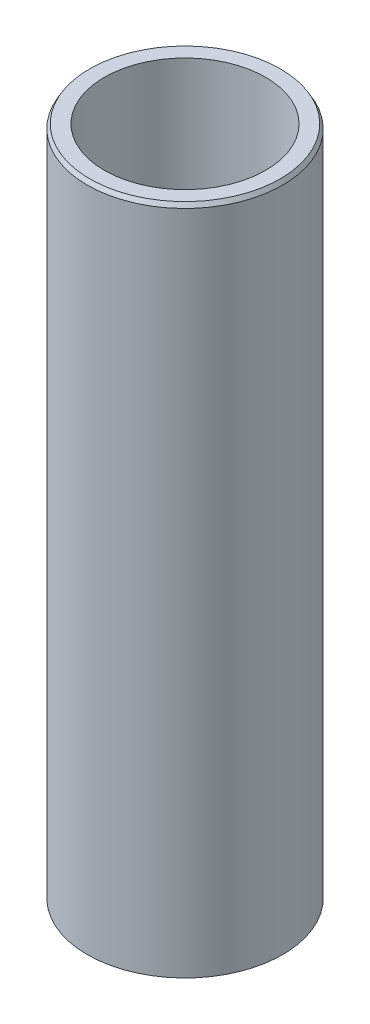
ISO-10303-21;
HEADER;
FILE_DESCRIPTION(('STEP AP214'),'2;1');
FILE_NAME('part.step','',(''),(''),'','','');
FILE_SCHEMA(('AUTOMOTIVE_DESIGN { 1 0 10303 214 1 1 1 1 }'));
ENDSEC;
DATA;
#1=APPLICATION_CONTEXT('core data for automotive mechanical design processes');
#2=APPLICATION_PROTOCOL_DEFINITION('international standard','automotive_design',2000,#1);
#3=PRODUCT_CONTEXT('',#1,'mechanical');
#4=PRODUCT('Part','Part','',(#3));
#5=PRODUCT_RELATED_PRODUCT_CATEGORY('part','',(#4));
#6=PRODUCT_DEFINITION_FORMATION('','',#4);
#7=PRODUCT_DEFINITION_CONTEXT('part definition',#1,'design');
#8=PRODUCT_DEFINITION('design','',#6,#7);
#9=PRODUCT_DEFINITION_SHAPE('','',#8);
#10=(LENGTH_UNIT() NAMED_UNIT(*) SI_UNIT(.MILLI.,.METRE.));
#11=(NAMED_UNIT(*) PLANE_ANGLE_UNIT() SI_UNIT($,.RADIAN.));
#12=(NAMED_UNIT(*) SI_UNIT($,.STERADIAN.) SOLID_ANGLE_UNIT());
#13=UNCERTAINTY_MEASURE_WITH_UNIT(LENGTH_MEASURE(1.E-05),#10,'distance_accuracy_value','');
#14=(GEOMETRIC_REPRESENTATION_CONTEXT(3) GLOBAL_UNCERTAINTY_ASSIGNED_CONTEXT((#13)) GLOBAL_UNIT_ASSIGNED_CONTEXT((#10,
#11,#12)) REPRESENTATION_CONTEXT('',''));
#15=CARTESIAN_POINT('',(0.,0.,0.));
#16=DIRECTION('',(0.,0.,1.));
#17=DIRECTION('',(1.,0.,0.));
#18=AXIS2_PLACEMENT_3D('',#15,#16,#17);
#19=CARTESIAN_POINT('',(0.,292.676516773877,0.));
#20=DIRECTION('',(0.,-1.,0.));
#21=DIRECTION('',(0.,0.,-1.));
#22=AXIS2_PLACEMENT_3D('',#19,#20,#21);
#23=CYLINDRICAL_SURFACE('',#22,42.5);
#24=CARTESIAN_POINT('',(0.,290.840660141569,0.));
#25=DIRECTION('',(0.,1.,0.));
#26=DIRECTION('',(0.,0.,1.));
#27=AXIS2_PLACEMENT_3D('',#24,#25,#26);
#28=CIRCLE('',#27,42.5);
#29=CARTESIAN_POINT('',(0.,290.840660141569,-42.5));
#30=VERTEX_POINT('',#29);
#31=EDGE_CURVE('E50',#30,#30,#28,.F.);
#32=CARTESIAN_POINT('',(0.,1.05993232085644,0.));
#33=DIRECTION('',(0.,1.,0.));
#34=DIRECTION('',(0.,0.,1.));
#35=AXIS2_PLACEMENT_3D('',#32,#33,#34);
#36=CIRCLE('',#35,42.5);
#37=CARTESIAN_POINT('',(0.,1.05993232085644,-42.5));
#38=VERTEX_POINT('',#37);
#39=EDGE_CURVE('E51',#38,#38,#36,.T.);
#40=CARTESIAN_POINT('',(0.,290.840660141569,-42.5));
#41=CARTESIAN_POINT('',(0.,287.822110893437,-42.5));
#42=CARTESIAN_POINT('',(0.,284.803561645305,-42.5));
#43=CARTESIAN_POINT('',(0.,278.76646314904,-42.5));
#44=CARTESIAN_POINT('',(0.,275.747913900907,-42.5));
#45=CARTESIAN_POINT('',(0.,269.710815404642,-42.5));
#46=CARTESIAN_POINT('',(0.,266.69226615651,-42.5));
#47=CARTESIAN_POINT('',(0.,260.655167660245,-42.5));
#48=CARTESIAN_POINT('',(0.,257.636618412113,-42.5));
#49=CARTESIAN_POINT('',(0.,251.599519915848,-42.5));
#50=CARTESIAN_POINT('',(0.,248.580970667715,-42.5));
#51=CARTESIAN_POINT('',(0.,242.543872171451,-42.5));
#52=CARTESIAN_POINT('',(0.,239.525322923318,-42.5));
#53=CARTESIAN_POINT('',(0.,233.488224427053,-42.5));
#54=CARTESIAN_POINT('',(0.,230.469675178921,-42.5));
#55=CARTESIAN_POINT('',(0.,224.432576682656,-42.5));
#56=CARTESIAN_POINT('',(0.,221.414027434524,-42.5));
#57=CARTESIAN_POINT('',(0.,215.376928938259,-42.5));
#58=CARTESIAN_POINT('',(0.,212.358379690126,-42.5));
#59=CARTESIAN_POINT('',(0.,206.321281193861,-42.5));
#60=CARTESIAN_POINT('',(0.,203.302731945729,-42.5));
#61=CARTESIAN_POINT('',(0.,197.265633449464,-42.5));
#62=CARTESIAN_POINT('',(0.,194.247084201332,-42.5));
#63=CARTESIAN_POINT('',(0.,188.209985705067,-42.5));
#64=CARTESIAN_POINT('',(0.,185.191436456934,-42.5));
#65=CARTESIAN_POINT('',(0.,179.15433796067,-42.5));
#66=CARTESIAN_POINT('',(0.,176.135788712537,-42.5));
#67=CARTESIAN_POINT('',(0.,170.098690216272,-42.5));
#68=CARTESIAN_POINT('',(0.,167.08014096814,-42.5));
#69=CARTESIAN_POINT('',(0.,161.043042471875,-42.5));
#70=CARTESIAN_POINT('',(0.,158.024493223743,-42.5));
#71=CARTESIAN_POINT('',(0.,151.987394727478,-42.5));
#72=CARTESIAN_POINT('',(0.,148.968845479345,-42.5));
#73=CARTESIAN_POINT('',(0.,142.931746983081,-42.5));
#74=CARTESIAN_POINT('',(0.,139.913197734948,-42.5));
#75=CARTESIAN_POINT('',(0.,133.876099238683,-42.5));
#76=CARTESIAN_POINT('',(0.,130.857549990551,-42.5));
#77=CARTESIAN_POINT('',(0.,124.820451494286,-42.5));
#78=CARTESIAN_POINT('',(0.,121.801902246154,-42.5));
#79=CARTESIAN_POINT('',(0.,115.764803749889,-42.5));
#80=CARTESIAN_POINT('',(0.,112.746254501756,-42.5));
#81=CARTESIAN_POINT('',(0.,106.709156005491,-42.5));
#82=CARTESIAN_POINT('',(0.,103.690606757359,-42.5));
#83=CARTESIAN_POINT('',(0.,97.6535082610941,-42.5));
#84=CARTESIAN_POINT('',(0.,94.6349590129617,-42.5));
#85=CARTESIAN_POINT('',(0.,88.5978605166968,-42.5));
#86=CARTESIAN_POINT('',(0.,85.5793112685644,-42.5));
#87=CARTESIAN_POINT('',(0.,79.5422127722995,-42.5));
#88=CARTESIAN_POINT('',(0.,76.5236635241671,-42.5));
#89=CARTESIAN_POINT('',(0.,70.4865650279023,-42.5));
#90=CARTESIAN_POINT('',(0.,67.4680157797699,-42.5));
#91=CARTESIAN_POINT('',(0.,61.430917283505,-42.5));
#92=CARTESIAN_POINT('',(0.,58.4123680353726,-42.5));
#93=CARTESIAN_POINT('',(0.,52.3752695391077,-42.5));
#94=CARTESIAN_POINT('',(0.,49.3567202909753,-42.5));
#95=CARTESIAN_POINT('',(0.,43.3196217947104,-42.5));
#96=CARTESIAN_POINT('',(0.,40.301072546578,-42.5));
#97=CARTESIAN_POINT('',(0.,34.2639740503132,-42.5));
#98=CARTESIAN_POINT('',(0.,31.2454248021808,-42.5));
#99=CARTESIAN_POINT('',(0.,25.2083263059159,-42.5));
#100=CARTESIAN_POINT('',(0.,22.1897770577834,-42.5));
#101=CARTESIAN_POINT('',(0.,16.1526785615185,-42.5));
#102=CARTESIAN_POINT('',(0.,13.1341293133861,-42.5));
#103=CARTESIAN_POINT('',(0.,7.09703081712128,-42.5));
#104=CARTESIAN_POINT('',(0.,4.07848156898886,-42.5));
#105=CARTESIAN_POINT('',(0.,1.05993232085644,-42.5));
#106=B_SPLINE_CURVE_WITH_KNOTS('',3,(#40,#41,#42,#43,#44,#45,#46,#47,#48,#49,#50,#51,#52,#53,
#54,#55,#56,#57,#58,#59,#60,#61,#62,#63,#64,#65,#66,#67,#68,#69,#70,#71,#72,#73,#74,#75,#76,#77,
#78,#79,#80,#81,#82,#83,#84,#85,#86,#87,#88,#89,#90,#91,#92,#93,#94,#95,#96,#97,#98,#99,#100,
#101,#102,#103,#104,#105),.UNSPECIFIED.,.F.,.F.,(4,2,2,2,2,2,2,2,2,2,2,2,2,2,2,2,2,2,2,2,2,2,2,
2,2,2,2,2,2,2,2,2,4),(0.,9.05564774439727,18.1112954887945,27.1669432331918,36.2225909775891,
45.2782387219864,54.3338864663837,63.3895342107809,72.4451819551782,81.5008296995755,
90.5564774439728,99.61212518837,108.667772932767,117.723420677165,126.779068421562,
135.834716165959,144.890363910356,153.946011654754,163.001659399151,172.057307143548,
181.112954887946,190.168602632343,199.22425037674,208.279898121137,217.335545865535,
226.391193609932,235.446841354329,244.502489098727,253.558136843124,262.613784587521,
271.669432331918,280.725080076316,289.780727820713),.UNSPECIFIED.);
#107=EDGE_CURVE('BSEAM39',#30,#38,#106,.T.);
#108=ORIENTED_EDGE('',*,*,#31,.T.);
#109=ORIENTED_EDGE('',*,*,#39,.T.);
#110=ORIENTED_EDGE('',*,*,#107,.T.);
#111=ORIENTED_EDGE('',*,*,#107,.F.);
#112=EDGE_LOOP('',(#108,#110,#109,#111));
#113=FACE_BOUND('',#112,.T.);
#114=ADVANCED_FACE('F39',(#113),#23,.T.);
#115=CARTESIAN_POINT('',(0.,292.676516773877,0.));
#116=DIRECTION('',(0.,1.,0.));
#117=DIRECTION('',(0.,0.,1.));
#118=AXIS2_PLACEMENT_3D('',#115,#116,#117);
#119=PLANE('',#118);
#120=CARTESIAN_POINT('',(0.,292.676516773877,0.));
#121=DIRECTION('',(0.,1.,0.));
#122=DIRECTION('',(0.,0.,1.));
#123=AXIS2_PLACEMENT_3D('',#120,#121,#122);
#124=CIRCLE('',#123,41.4400676791435);
#125=CARTESIAN_POINT('',(0.,292.676516773877,-41.4400676791436));
#126=VERTEX_POINT('',#125);
#127=EDGE_CURVE('E54',#126,#126,#124,.T.);
#128=ORIENTED_EDGE('',*,*,#127,.T.);
#129=EDGE_LOOP('',(#128));
#130=FACE_BOUND('',#129,.T.);
#131=CARTESIAN_POINT('',(0.,292.676516773877,0.));
#132=DIRECTION('',(0.,1.,0.));
#133=DIRECTION('',(0.,0.,1.));
#134=AXIS2_PLACEMENT_3D('',#131,#132,#133);
#135=CIRCLE('',#134,35.0735279360888);
#136=CARTESIAN_POINT('',(0.,292.676516773877,35.0735279360888));
#137=VERTEX_POINT('',#136);
#138=EDGE_CURVE('E58',#137,#137,#135,.T.);
#139=ORIENTED_EDGE('',*,*,#138,.F.);
#140=EDGE_LOOP('',(#139));
#141=FACE_BOUND('',#140,.T.);
#142=ADVANCED_FACE('F69',(#130,#141),#119,.T.);
#143=CARTESIAN_POINT('',(0.,0.,0.));
#144=DIRECTION('',(0.,1.,0.));
#145=DIRECTION('',(0.,0.,1.));
#146=AXIS2_PLACEMENT_3D('',#143,#144,#145);
#147=PLANE('',#146);
#148=CARTESIAN_POINT('',(0.,0.,0.));
#149=DIRECTION('',(0.,1.,0.));
#150=DIRECTION('',(0.,0.,1.));
#151=AXIS2_PLACEMENT_3D('',#148,#149,#150);
#152=CIRCLE('',#151,40.6641433676923);
#153=CARTESIAN_POINT('',(0.,0.,40.6641433676923));
#154=VERTEX_POINT('',#153);
#155=EDGE_CURVE('E10',#154,#154,#152,.F.);
#156=ORIENTED_EDGE('',*,*,#155,.T.);
#157=EDGE_LOOP('',(#156));
#158=FACE_BOUND('',#157,.T.);
#159=CARTESIAN_POINT('',(0.,0.,0.));
#160=DIRECTION('',(0.,1.,0.));
#161=DIRECTION('',(0.,0.,1.));
#162=AXIS2_PLACEMENT_3D('',#159,#160,#161);
#163=CIRCLE('',#162,35.0735279360888);
#164=CARTESIAN_POINT('',(0.,0.,35.0735279360888));
#165=VERTEX_POINT('',#164);
#166=EDGE_CURVE('E63',#165,#165,#163,.T.);
#167=ORIENTED_EDGE('',*,*,#166,.T.);
#168=EDGE_LOOP('',(#167));
#169=FACE_BOUND('',#168,.T.);
#170=ADVANCED_FACE('F75',(#158,#169),#147,.F.);
#171=CARTESIAN_POINT('',(0.,292.676516773877,0.));
#172=DIRECTION('',(0.,-1.,0.));
#173=DIRECTION('',(0.,0.,-1.));
#174=AXIS2_PLACEMENT_3D('',#171,#172,#173);
#175=CYLINDRICAL_SURFACE('',#174,35.0735279360888);
#176=ORIENTED_EDGE('',*,*,#138,.T.);
#177=EDGE_LOOP('',(#176));
#178=FACE_BOUND('',#177,.T.);
#179=ORIENTED_EDGE('',*,*,#166,.F.);
#180=EDGE_LOOP('',(#179));
#181=FACE_BOUND('',#180,.T.);
#182=ADVANCED_FACE('F70',(#178,#181),#175,.F.);
#183=CARTESIAN_POINT('',(0.,292.676516773877,0.));
#184=DIRECTION('',(0.,-1.,0.));
#185=DIRECTION('',(0.,0.,-1.));
#186=AXIS2_PLACEMENT_3D('',#183,#184,#185);
#187=CONICAL_SURFACE('',#186,41.4400676791435,0.523598775598288);
#188=CARTESIAN_POINT('',(0.,290.840660141569,-42.5));
#189=CARTESIAN_POINT('',(0.,290.859783648156,-42.4889590383244));
#190=CARTESIAN_POINT('',(0.,290.878907154743,-42.4779180766488));
#191=CARTESIAN_POINT('',(0.,290.917154167916,-42.4558361532977));
#192=CARTESIAN_POINT('',(0.,290.936277674502,-42.4447951916221));
#193=CARTESIAN_POINT('',(0.,290.974524687675,-42.4227132682709));
#194=CARTESIAN_POINT('',(0.,290.993648194262,-42.4116723065953));
#195=CARTESIAN_POINT('',(0.,291.031895207435,-42.3895903832441));
#196=CARTESIAN_POINT('',(0.,291.051018714021,-42.3785494215686));
#197=CARTESIAN_POINT('',(0.,291.089265727194,-42.3564674982174));
#198=CARTESIAN_POINT('',(0.,291.108389233781,-42.3454265365418));
#199=CARTESIAN_POINT('',(0.,291.146636246954,-42.3233446131906));
#200=CARTESIAN_POINT('',(0.,291.165759753541,-42.312303651515));
#201=CARTESIAN_POINT('',(0.,291.204006766714,-42.2902217281638));
#202=CARTESIAN_POINT('',(0.,291.2231302733,-42.2791807664883));
#203=CARTESIAN_POINT('',(0.,291.261377286473,-42.2570988431371));
#204=CARTESIAN_POINT('',(0.,291.28050079306,-42.2460578814615));
#205=CARTESIAN_POINT('',(0.,291.318747806233,-42.2239759581103));
#206=CARTESIAN_POINT('',(0.,291.337871312819,-42.2129349964347));
#207=CARTESIAN_POINT('',(0.,291.376118325993,-42.1908530730836));
#208=CARTESIAN_POINT('',(0.,291.395241832579,-42.179812111408));
#209=CARTESIAN_POINT('',(0.,291.433488845752,-42.1577301880568));
#210=CARTESIAN_POINT('',(0.,291.452612352339,-42.1466892263812));
#211=CARTESIAN_POINT('',(0.,291.490859365512,-42.12460730303));
#212=CARTESIAN_POINT('',(0.,291.509982872098,-42.1135663413544));
#213=CARTESIAN_POINT('',(0.,291.548229885271,-42.0914844180033));
#214=CARTESIAN_POINT('',(0.,291.567353391858,-42.0804434563277));
#215=CARTESIAN_POINT('',(0.,291.605600405031,-42.0583615329765));
#216=CARTESIAN_POINT('',(0.,291.624723911618,-42.0473205713009));
#217=CARTESIAN_POINT('',(0.,291.662970924791,-42.0252386479497));
#218=CARTESIAN_POINT('',(0.,291.682094431377,-42.0141976862741));
#219=CARTESIAN_POINT('',(0.,291.72034144455,-41.992115762923));
#220=CARTESIAN_POINT('',(0.,291.739464951137,-41.9810748012474));
#221=CARTESIAN_POINT('',(0.,291.77771196431,-41.9589928778962));
#222=CARTESIAN_POINT('',(0.,291.796835470896,-41.9479519162206));
#223=CARTESIAN_POINT('',(0.,291.83508248407,-41.9258699928694));
#224=CARTESIAN_POINT('',(0.,291.854205990656,-41.9148290311939));
#225=CARTESIAN_POINT('',(0.,291.892453003829,-41.8927471078427));
#226=CARTESIAN_POINT('',(0.,291.911576510416,-41.8817061461671));
#227=CARTESIAN_POINT('',(0.,291.949823523589,-41.8596242228159));
#228=CARTESIAN_POINT('',(0.,291.968947030175,-41.8485832611403));
#229=CARTESIAN_POINT('',(0.,292.007194043348,-41.8265013377892));
#230=CARTESIAN_POINT('',(0.,292.026317549935,-41.8154603761136));
#231=CARTESIAN_POINT('',(0.,292.064564563108,-41.7933784527624));
#232=CARTESIAN_POINT('',(0.,292.083688069695,-41.7823374910868));
#233=CARTESIAN_POINT('',(0.,292.121935082868,-41.7602555677356));
#234=CARTESIAN_POINT('',(0.,292.141058589454,-41.74921460606));
#235=CARTESIAN_POINT('',(0.,292.179305602627,-41.7271326827088));
#236=CARTESIAN_POINT('',(0.,292.198429109214,-41.7160917210333));
#237=CARTESIAN_POINT('',(0.,292.236676122387,-41.6940097976821));
#238=CARTESIAN_POINT('',(0.,292.255799628973,-41.6829688360065));
#239=CARTESIAN_POINT('',(0.,292.294046642146,-41.6608869126553));
#240=CARTESIAN_POINT('',(0.,292.313170148733,-41.6498459509797));
#241=CARTESIAN_POINT('',(0.,292.351417161906,-41.6277640276286));
#242=CARTESIAN_POINT('',(0.,292.370540668493,-41.616723065953));
#243=CARTESIAN_POINT('',(0.,292.408787681666,-41.5946411426018));
#244=CARTESIAN_POINT('',(0.,292.427911188252,-41.5836001809262));
#245=CARTESIAN_POINT('',(0.,292.466158201425,-41.561518257575));
#246=CARTESIAN_POINT('',(0.,292.485281708012,-41.5504772958994));
#247=CARTESIAN_POINT('',(0.,292.523528721185,-41.5283953725483));
#248=CARTESIAN_POINT('',(0.,292.542652227771,-41.5173544108727));
#249=CARTESIAN_POINT('',(0.,292.580899240945,-41.4952724875215));
#250=CARTESIAN_POINT('',(0.,292.600022747531,-41.4842315258459));
#251=CARTESIAN_POINT('',(0.,292.638269760704,-41.4621496024947));
#252=CARTESIAN_POINT('',(0.,292.657393267291,-41.4511086408191));
#253=CARTESIAN_POINT('',(0.,292.676516773877,-41.4400676791436));
#254=B_SPLINE_CURVE_WITH_KNOTS('',3,(#188,#189,#190,#191,#192,#193,#194,#195,#196,#197,#198,
#199,#200,#201,#202,#203,#204,#205,#206,#207,#208,#209,#210,#211,#212,#213,#214,#215,#216,#217,
#218,#219,#220,#221,#222,#223,#224,#225,#226,#227,#228,#229,#230,#231,#232,#233,#234,#235,#236,
#237,#238,#239,#240,#241,#242,#243,#244,#245,#246,#247,#248,#249,#250,#251,#252,#253),
.UNSPECIFIED.,.F.,.F.,(4,2,2,2,2,2,2,2,2,2,2,2,2,2,2,2,2,2,2,2,2,2,2,2,2,2,2,2,2,2,2,2,4),(0.,
0.0662457700534863,0.132491540107021,0.198737310160555,0.26498308021409,0.331228850267624,
0.397474620321159,0.463720390374696,0.529966160428231,0.596211930481765,0.6624577005353,
0.728703470588786,0.794949240642321,0.861195010695855,0.927440780749389,0.993686550802927,
1.05993232085646,1.12617809091,1.19242386096353,1.25866963101706,1.3249154010706,
1.39116117112413,1.45740694117762,1.52365271123116,1.58989848128469,1.65614425133823,
1.72239002139176,1.78863579144529,1.85488156149883,1.92112733155236,1.9873731016059,
2.05361887165944,2.11986464171297),.UNSPECIFIED.);
#255=EDGE_CURVE('BSEAM81',#30,#126,#254,.T.);
#256=ORIENTED_EDGE('',*,*,#31,.F.);
#257=ORIENTED_EDGE('',*,*,#127,.F.);
#258=ORIENTED_EDGE('',*,*,#255,.T.);
#259=ORIENTED_EDGE('',*,*,#255,.F.);
#260=EDGE_LOOP('',(#256,#258,#257,#259));
#261=FACE_BOUND('',#260,.T.);
#262=ADVANCED_FACE('F81',(#261),#187,.T.);
#263=CARTESIAN_POINT('',(0.,1.05993232085644,0.));
#264=DIRECTION('',(0.,1.,0.));
#265=DIRECTION('',(0.,0.,1.));
#266=AXIS2_PLACEMENT_3D('',#263,#264,#265);
#267=CONICAL_SURFACE('',#266,42.5,1.0471975511966);
#268=ORIENTED_EDGE('',*,*,#155,.F.);
#269=EDGE_LOOP('',(#268));
#270=FACE_BOUND('',#269,.T.);
#271=ORIENTED_EDGE('',*,*,#39,.F.);
#272=EDGE_LOOP('',(#271));
#273=FACE_BOUND('',#272,.T.);
#274=ADVANCED_FACE('F45',(#270,#273),#267,.T.);
#275=CLOSED_SHELL('',(#114,#142,#170,#182,#262,#274));
#276=MANIFOLD_SOLID_BREP('B2',#275);
#277=ADVANCED_BREP_SHAPE_REPRESENTATION('',(#18,#276),#14);
#278=SHAPE_DEFINITION_REPRESENTATION(#9,#277);
ENDSEC;
END-ISO-10303-21;
